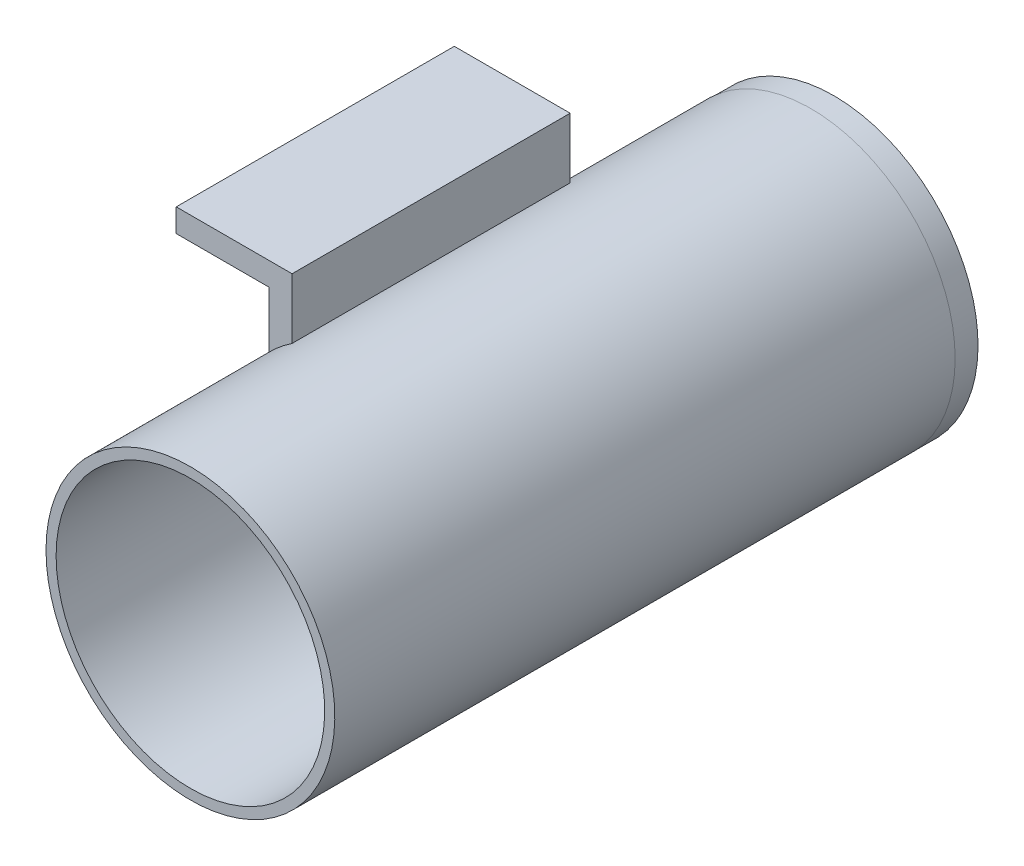
ISO-10303-21;
HEADER;
FILE_DESCRIPTION(('STEP AP214'),'2;1');
FILE_NAME('part.step','',(''),(''),'','','');
FILE_SCHEMA(('AUTOMOTIVE_DESIGN { 1 0 10303 214 1 1 1 1 }'));
ENDSEC;
DATA;
#1=APPLICATION_CONTEXT('core data for automotive mechanical design processes');
#2=APPLICATION_PROTOCOL_DEFINITION('international standard','automotive_design',2000,#1);
#3=PRODUCT_CONTEXT('',#1,'mechanical');
#4=PRODUCT('Part','Part','',(#3));
#5=PRODUCT_RELATED_PRODUCT_CATEGORY('part','',(#4));
#6=PRODUCT_DEFINITION_FORMATION('','',#4);
#7=PRODUCT_DEFINITION_CONTEXT('part definition',#1,'design');
#8=PRODUCT_DEFINITION('design','',#6,#7);
#9=PRODUCT_DEFINITION_SHAPE('','',#8);
#10=(LENGTH_UNIT() NAMED_UNIT(*) SI_UNIT(.MILLI.,.METRE.));
#11=(NAMED_UNIT(*) PLANE_ANGLE_UNIT() SI_UNIT($,.RADIAN.));
#12=(NAMED_UNIT(*) SI_UNIT($,.STERADIAN.) SOLID_ANGLE_UNIT());
#13=UNCERTAINTY_MEASURE_WITH_UNIT(LENGTH_MEASURE(1.E-05),#10,'distance_accuracy_value','');
#14=(GEOMETRIC_REPRESENTATION_CONTEXT(3) GLOBAL_UNCERTAINTY_ASSIGNED_CONTEXT((#13)) GLOBAL_UNIT_ASSIGNED_CONTEXT((#10,
#11,#12)) REPRESENTATION_CONTEXT('',''));
#15=CARTESIAN_POINT('',(0.,0.,0.));
#16=DIRECTION('',(0.,0.,1.));
#17=DIRECTION('',(1.,0.,0.));
#18=AXIS2_PLACEMENT_3D('',#15,#16,#17);
#19=CARTESIAN_POINT('',(-9.81200661546478,0.,38.1));
#20=DIRECTION('',(1.,0.,0.));
#21=DIRECTION('',(0.,1.,0.));
#22=AXIS2_PLACEMENT_3D('',#19,#20,#21);
#23=PLANE('',#22);
#24=DIRECTION('',(0.,0.,1.));
#25=VECTOR('',#24,1.);
#26=CARTESIAN_POINT('',(-9.81200661546478,0.974223450392017,-22.));
#27=LINE('',#26,#25);
#28=CARTESIAN_POINT('',(-9.81200661546478,0.974223450392015,38.1));
#29=VERTEX_POINT('',#28);
#30=CARTESIAN_POINT('',(-9.81200661546478,0.974223450392015,0.));
#31=VERTEX_POINT('',#30);
#32=EDGE_CURVE('E207',#29,#31,#27,.F.);
#33=ORIENTED_EDGE('',*,*,#32,.F.);
#34=DIRECTION('',(0.,-1.,0.));
#35=VECTOR('',#34,1.);
#36=CARTESIAN_POINT('',(-9.81200661546478,0.,38.1));
#37=LINE('',#36,#35);
#38=CARTESIAN_POINT('',(-9.81200661546479,8.7007021203464,38.1));
#39=VERTEX_POINT('',#38);
#40=EDGE_CURVE('E220',#39,#29,#37,.T.);
#41=ORIENTED_EDGE('',*,*,#40,.F.);
#42=DIRECTION('',(0.,0.,-1.));
#43=VECTOR('',#42,1.);
#44=CARTESIAN_POINT('',(-9.81200661546479,8.7007021203464,38.1));
#45=LINE('',#44,#43);
#46=CARTESIAN_POINT('',(-9.81200661546479,8.7007021203464,0.));
#47=VERTEX_POINT('',#46);
#48=EDGE_CURVE('E254',#39,#47,#45,.T.);
#49=ORIENTED_EDGE('',*,*,#48,.T.);
#50=DIRECTION('',(0.,-1.,0.));
#51=VECTOR('',#50,1.);
#52=CARTESIAN_POINT('',(-9.81200661546478,0.,0.));
#53=LINE('',#52,#51);
#54=EDGE_CURVE('E238',#47,#31,#53,.T.);
#55=ORIENTED_EDGE('',*,*,#54,.T.);
#56=EDGE_LOOP('',(#33,#41,#49,#55));
#57=FACE_BOUND('',#56,.T.);
#58=ADVANCED_FACE('F34',(#57),#23,.F.);
#59=CARTESIAN_POINT('',(-6.63700661546478,0.,38.1));
#60=DIRECTION('',(1.,0.,0.));
#61=DIRECTION('',(0.,1.,0.));
#62=AXIS2_PLACEMENT_3D('',#59,#60,#61);
#63=PLANE('',#62);
#64=DIRECTION('',(0.,-1.,0.));
#65=VECTOR('',#64,1.);
#66=CARTESIAN_POINT('',(-6.63700661546478,0.,38.1));
#67=LINE('',#66,#65);
#68=CARTESIAN_POINT('',(-6.63700661546479,11.8757021203464,38.1));
#69=VERTEX_POINT('',#68);
#70=CARTESIAN_POINT('',(-6.63700661546478,3.60496778517396,38.1));
#71=VERTEX_POINT('',#70);
#72=EDGE_CURVE('E227',#69,#71,#67,.T.);
#73=ORIENTED_EDGE('',*,*,#72,.T.);
#74=DIRECTION('',(0.,0.,1.));
#75=VECTOR('',#74,1.);
#76=CARTESIAN_POINT('',(-6.63700661546478,3.60496778517396,-22.));
#77=LINE('',#76,#75);
#78=CARTESIAN_POINT('',(-6.63700661546478,3.60496778517396,0.));
#79=VERTEX_POINT('',#78);
#80=EDGE_CURVE('E204',#71,#79,#77,.F.);
#81=ORIENTED_EDGE('',*,*,#80,.T.);
#82=DIRECTION('',(0.,-1.,0.));
#83=VECTOR('',#82,1.);
#84=CARTESIAN_POINT('',(-6.63700661546478,0.,0.));
#85=LINE('',#84,#83);
#86=CARTESIAN_POINT('',(-6.63700661546479,11.8757021203464,0.));
#87=VERTEX_POINT('',#86);
#88=EDGE_CURVE('E244',#87,#79,#85,.T.);
#89=ORIENTED_EDGE('',*,*,#88,.F.);
#90=DIRECTION('',(0.,0.,-1.));
#91=VECTOR('',#90,1.);
#92=CARTESIAN_POINT('',(-6.63700661546479,11.8757021203464,38.1));
#93=LINE('',#92,#91);
#94=EDGE_CURVE('E249',#69,#87,#93,.T.);
#95=ORIENTED_EDGE('',*,*,#94,.F.);
#96=EDGE_LOOP('',(#73,#81,#89,#95));
#97=FACE_BOUND('',#96,.T.);
#98=ADVANCED_FACE('F285',(#97),#63,.T.);
#99=CARTESIAN_POINT('',(-22.5120066154648,0.,38.1));
#100=DIRECTION('',(-1.,0.,0.));
#101=DIRECTION('',(0.,0.,1.));
#102=AXIS2_PLACEMENT_3D('',#99,#100,#101);
#103=PLANE('',#102);
#104=DIRECTION('',(0.,1.,0.));
#105=VECTOR('',#104,1.);
#106=CARTESIAN_POINT('',(-22.5120066154648,0.,0.));
#107=LINE('',#106,#105);
#108=CARTESIAN_POINT('',(-22.5120066154648,8.7007021203464,0.));
#109=VERTEX_POINT('',#108);
#110=CARTESIAN_POINT('',(-22.5120066154648,11.8757021203464,0.));
#111=VERTEX_POINT('',#110);
#112=EDGE_CURVE('E212',#109,#111,#107,.T.);
#113=ORIENTED_EDGE('',*,*,#112,.F.);
#114=DIRECTION('',(0.,0.,-1.));
#115=VECTOR('',#114,1.);
#116=CARTESIAN_POINT('',(-22.5120066154648,8.7007021203464,38.1));
#117=LINE('',#116,#115);
#118=CARTESIAN_POINT('',(-22.5120066154648,8.7007021203464,38.1));
#119=VERTEX_POINT('',#118);
#120=EDGE_CURVE('E256',#119,#109,#117,.T.);
#121=ORIENTED_EDGE('',*,*,#120,.F.);
#122=DIRECTION('',(0.,1.,0.));
#123=VECTOR('',#122,1.);
#124=CARTESIAN_POINT('',(-22.5120066154648,0.,38.1));
#125=LINE('',#124,#123);
#126=CARTESIAN_POINT('',(-22.5120066154648,11.8757021203464,38.1));
#127=VERTEX_POINT('',#126);
#128=EDGE_CURVE('E213',#119,#127,#125,.T.);
#129=ORIENTED_EDGE('',*,*,#128,.T.);
#130=DIRECTION('',(0.,0.,-1.));
#131=VECTOR('',#130,1.);
#132=CARTESIAN_POINT('',(-22.5120066154648,11.8757021203464,38.1));
#133=LINE('',#132,#131);
#134=EDGE_CURVE('E232',#127,#111,#133,.T.);
#135=ORIENTED_EDGE('',*,*,#134,.T.);
#136=EDGE_LOOP('',(#113,#121,#129,#135));
#137=FACE_BOUND('',#136,.T.);
#138=ADVANCED_FACE('F36',(#137),#103,.T.);
#139=CARTESIAN_POINT('',(0.,8.7007021203464,38.1));
#140=DIRECTION('',(0.,-1.,0.));
#141=DIRECTION('',(0.,0.,-1.));
#142=AXIS2_PLACEMENT_3D('',#139,#140,#141);
#143=PLANE('',#142);
#144=DIRECTION('',(-1.,0.,0.));
#145=VECTOR('',#144,1.);
#146=CARTESIAN_POINT('',(0.,8.7007021203464,0.));
#147=LINE('',#146,#145);
#148=EDGE_CURVE('E235',#47,#109,#147,.T.);
#149=ORIENTED_EDGE('',*,*,#148,.F.);
#150=ORIENTED_EDGE('',*,*,#48,.F.);
#151=DIRECTION('',(-1.,0.,0.));
#152=VECTOR('',#151,1.);
#153=CARTESIAN_POINT('',(0.,8.7007021203464,38.1));
#154=LINE('',#153,#152);
#155=EDGE_CURVE('E216',#39,#119,#154,.T.);
#156=ORIENTED_EDGE('',*,*,#155,.T.);
#157=ORIENTED_EDGE('',*,*,#120,.T.);
#158=EDGE_LOOP('',(#149,#150,#156,#157));
#159=FACE_BOUND('',#158,.T.);
#160=ADVANCED_FACE('F301',(#159),#143,.T.);
#161=CARTESIAN_POINT('',(0.,11.8757021203464,38.1));
#162=DIRECTION('',(0.,-1.,0.));
#163=DIRECTION('',(1.,0.,0.));
#164=AXIS2_PLACEMENT_3D('',#161,#162,#163);
#165=PLANE('',#164);
#166=DIRECTION('',(-1.,0.,0.));
#167=VECTOR('',#166,1.);
#168=CARTESIAN_POINT('',(0.,11.8757021203464,0.));
#169=LINE('',#168,#167);
#170=EDGE_CURVE('E217',#87,#111,#169,.T.);
#171=ORIENTED_EDGE('',*,*,#170,.T.);
#172=ORIENTED_EDGE('',*,*,#134,.F.);
#173=DIRECTION('',(-1.,0.,0.));
#174=VECTOR('',#173,1.);
#175=CARTESIAN_POINT('',(0.,11.8757021203464,38.1));
#176=LINE('',#175,#174);
#177=EDGE_CURVE('E230',#69,#127,#176,.T.);
#178=ORIENTED_EDGE('',*,*,#177,.F.);
#179=ORIENTED_EDGE('',*,*,#94,.T.);
#180=EDGE_LOOP('',(#171,#172,#178,#179));
#181=FACE_BOUND('',#180,.T.);
#182=ADVANCED_FACE('F291',(#181),#165,.F.);
#183=CARTESIAN_POINT('',(0.,0.,38.1));
#184=DIRECTION('',(0.,0.,1.));
#185=DIRECTION('',(1.,0.,0.));
#186=AXIS2_PLACEMENT_3D('',#183,#184,#185);
#187=PLANE('',#186);
#188=ORIENTED_EDGE('',*,*,#40,.T.);
#189=CARTESIAN_POINT('',(4.32977813053361,-12.8619542844802,38.1));
#190=DIRECTION('',(0.,0.,1.));
#191=DIRECTION('',(1.,0.,0.));
#192=AXIS2_PLACEMENT_3D('',#189,#190,#191);
#193=CIRCLE('',#192,19.7845871858153);
#194=EDGE_CURVE('E210',#29,#71,#193,.F.);
#195=ORIENTED_EDGE('',*,*,#194,.T.);
#196=ORIENTED_EDGE('',*,*,#72,.F.);
#197=ORIENTED_EDGE('',*,*,#177,.T.);
#198=ORIENTED_EDGE('',*,*,#128,.F.);
#199=ORIENTED_EDGE('',*,*,#155,.F.);
#200=EDGE_LOOP('',(#188,#195,#196,#197,#198,#199));
#201=FACE_BOUND('',#200,.T.);
#202=ADVANCED_FACE('F279',(#201),#187,.T.);
#203=CARTESIAN_POINT('',(0.,0.,0.));
#204=DIRECTION('',(0.,0.,1.));
#205=DIRECTION('',(1.,0.,0.));
#206=AXIS2_PLACEMENT_3D('',#203,#204,#205);
#207=PLANE('',#206);
#208=CARTESIAN_POINT('',(4.32977813053361,-12.8619542844802,0.));
#209=DIRECTION('',(0.,0.,1.));
#210=DIRECTION('',(1.,0.,0.));
#211=AXIS2_PLACEMENT_3D('',#208,#209,#210);
#212=CIRCLE('',#211,19.7845871858153);
#213=EDGE_CURVE('E11',#31,#79,#212,.F.);
#214=ORIENTED_EDGE('',*,*,#213,.F.);
#215=ORIENTED_EDGE('',*,*,#54,.F.);
#216=ORIENTED_EDGE('',*,*,#148,.T.);
#217=ORIENTED_EDGE('',*,*,#112,.T.);
#218=ORIENTED_EDGE('',*,*,#170,.F.);
#219=ORIENTED_EDGE('',*,*,#88,.T.);
#220=EDGE_LOOP('',(#214,#215,#216,#217,#218,#219));
#221=FACE_BOUND('',#220,.T.);
#222=ADVANCED_FACE('F288',(#221),#207,.F.);
#223=CARTESIAN_POINT('',(4.32977813053361,-12.8619542844802,-22.));
#224=DIRECTION('',(0.,0.,-1.));
#225=DIRECTION('',(-1.,0.,0.));
#226=AXIS2_PLACEMENT_3D('',#223,#224,#225);
#227=PLANE('',#226);
#228=CARTESIAN_POINT('',(4.32977813053361,-12.8619542844802,-22.));
#229=DIRECTION('',(0.,0.,-1.));
#230=DIRECTION('',(-1.,0.,0.));
#231=AXIS2_PLACEMENT_3D('',#228,#229,#230);
#232=CIRCLE('',#231,19.7845871858153);
#233=CARTESIAN_POINT('',(1.9897508336412,-32.507670417086,-22.));
#234=VERTEX_POINT('',#233);
#235=EDGE_CURVE('E193',#234,#234,#232,.T.);
#236=ORIENTED_EDGE('',*,*,#235,.T.);
#237=CARTESIAN_POINT('',(4.3255656269204,-12.897320389099,-22.));
#238=DIRECTION('',(0.,0.,-1.));
#239=DIRECTION('',(-1.,0.,0.));
#240=AXIS2_PLACEMENT_3D('',#237,#238,#239);
#241=CIRCLE('',#240,19.7489710863294);
#242=EDGE_CURVE('E177',#234,#234,#241,.T.);
#243=ORIENTED_EDGE('',*,*,#242,.F.);
#244=EDGE_LOOP('',(#236,#243));
#245=FACE_BOUND('',#244,.T.);
#246=ADVANCED_FACE('F329',(#245),#227,.T.);
#247=CARTESIAN_POINT('',(4.32977813053361,-12.8619542844802,-22.));
#248=DIRECTION('',(0.,0.,1.));
#249=DIRECTION('',(1.,0.,0.));
#250=AXIS2_PLACEMENT_3D('',#247,#248,#249);
#251=CYLINDRICAL_SURFACE('',#250,19.7845871858153);
#252=ORIENTED_EDGE('',*,*,#194,.F.);
#253=ORIENTED_EDGE('',*,*,#32,.T.);
#254=ORIENTED_EDGE('',*,*,#213,.T.);
#255=ORIENTED_EDGE('',*,*,#80,.F.);
#256=EDGE_LOOP('',(#252,#253,#254,#255));
#257=FACE_BOUND('',#256,.T.);
#258=ORIENTED_EDGE('',*,*,#235,.F.);
#259=EDGE_LOOP('',(#258));
#260=FACE_BOUND('',#259,.T.);
#261=CARTESIAN_POINT('',(4.32977813053361,-12.8619542844802,63.));
#262=DIRECTION('',(0.,0.,-1.));
#263=DIRECTION('',(-1.,0.,0.));
#264=AXIS2_PLACEMENT_3D('',#261,#262,#263);
#265=CIRCLE('',#264,19.7845871858153);
#266=CARTESIAN_POINT('',(-15.4548090552817,-12.8619542844802,63.));
#267=VERTEX_POINT('',#266);
#268=EDGE_CURVE('E190',#267,#267,#265,.T.);
#269=ORIENTED_EDGE('',*,*,#268,.T.);
#270=EDGE_LOOP('',(#269));
#271=FACE_BOUND('',#270,.T.);
#272=ADVANCED_FACE('F319',(#257,#260,#271),#251,.T.);
#273=CARTESIAN_POINT('',(4.32977813053361,-12.8619542844802,-22.));
#274=DIRECTION('',(0.,0.,1.));
#275=DIRECTION('',(1.,0.,0.));
#276=AXIS2_PLACEMENT_3D('',#273,#274,#275);
#277=CYLINDRICAL_SURFACE('',#276,18.3999999999997);
#278=DIRECTION('',(0.,0.,1.));
#279=VECTOR('',#278,1.);
#280=CARTESIAN_POINT('',(-7.91100601521927,0.875702120346397,-22.));
#281=LINE('',#280,#279);
#282=CARTESIAN_POINT('',(-7.91100601521927,0.875702120346397,38.1));
#283=VERTEX_POINT('',#282);
#284=CARTESIAN_POINT('',(-7.91100601521927,0.8757021203464,0.));
#285=VERTEX_POINT('',#284);
#286=EDGE_CURVE('E199',#283,#285,#281,.F.);
#287=ORIENTED_EDGE('',*,*,#286,.F.);
#288=CARTESIAN_POINT('',(4.32977813053361,-12.8619542844802,38.1));
#289=DIRECTION('',(0.,0.,1.));
#290=DIRECTION('',(1.,0.,0.));
#291=AXIS2_PLACEMENT_3D('',#288,#289,#290);
#292=CIRCLE('',#291,18.3999999999997);
#293=CARTESIAN_POINT('',(-6.63700661546478,1.91267370863439,38.1));
#294=VERTEX_POINT('',#293);
#295=EDGE_CURVE('E202',#283,#294,#292,.F.);
#296=ORIENTED_EDGE('',*,*,#295,.T.);
#297=DIRECTION('',(0.,0.,1.));
#298=VECTOR('',#297,1.);
#299=CARTESIAN_POINT('',(-6.63700661546478,1.91267370863439,-22.));
#300=LINE('',#299,#298);
#301=CARTESIAN_POINT('',(-6.63700661546478,1.91267370863439,0.));
#302=VERTEX_POINT('',#301);
#303=EDGE_CURVE('E197',#294,#302,#300,.F.);
#304=ORIENTED_EDGE('',*,*,#303,.T.);
#305=CARTESIAN_POINT('',(4.32977813053361,-12.8619542844802,0.));
#306=DIRECTION('',(0.,0.,1.));
#307=DIRECTION('',(1.,0.,0.));
#308=AXIS2_PLACEMENT_3D('',#305,#306,#307);
#309=CIRCLE('',#308,18.3999999999997);
#310=EDGE_CURVE('E42',#285,#302,#309,.F.);
#311=ORIENTED_EDGE('',*,*,#310,.F.);
#312=EDGE_LOOP('',(#287,#296,#304,#311));
#313=FACE_BOUND('',#312,.T.);
#314=CARTESIAN_POINT('',(4.32977813053361,-12.8619542844802,-22.));
#315=DIRECTION('',(0.,0.,-1.));
#316=DIRECTION('',(-1.,0.,0.));
#317=AXIS2_PLACEMENT_3D('',#314,#315,#316);
#318=CIRCLE('',#317,18.3999999999997);
#319=CARTESIAN_POINT('',(12.7789529267375,-29.2073342208164,-22.));
#320=VERTEX_POINT('',#319);
#321=CARTESIAN_POINT('',(11.4074617032265,-29.8462527758758,-22.));
#322=VERTEX_POINT('',#321);
#323=EDGE_CURVE('E145',#320,#322,#318,.T.);
#324=ORIENTED_EDGE('',*,*,#323,.T.);
#325=EDGE_CURVE('E184',#322,#320,#318,.T.);
#326=ORIENTED_EDGE('',*,*,#325,.T.);
#327=EDGE_LOOP('',(#324,#326));
#328=FACE_BOUND('',#327,.T.);
#329=CARTESIAN_POINT('',(4.32977813053361,-12.8619542844802,63.));
#330=DIRECTION('',(0.,0.,-1.));
#331=DIRECTION('',(-1.,0.,0.));
#332=AXIS2_PLACEMENT_3D('',#329,#330,#331);
#333=CIRCLE('',#332,18.3999999999997);
#334=CARTESIAN_POINT('',(-14.0702218694661,-12.8619542844802,63.));
#335=VERTEX_POINT('',#334);
#336=EDGE_CURVE('E187',#335,#335,#333,.T.);
#337=ORIENTED_EDGE('',*,*,#336,.F.);
#338=EDGE_LOOP('',(#337));
#339=FACE_BOUND('',#338,.T.);
#340=ADVANCED_FACE('F273',(#313,#328,#339),#277,.F.);
#341=CARTESIAN_POINT('',(4.32977813053361,-12.8619542844802,63.));
#342=DIRECTION('',(0.,0.,-1.));
#343=DIRECTION('',(-1.,0.,0.));
#344=AXIS2_PLACEMENT_3D('',#341,#342,#343);
#345=PLANE('',#344);
#346=ORIENTED_EDGE('',*,*,#336,.T.);
#347=EDGE_LOOP('',(#346));
#348=FACE_BOUND('',#347,.T.);
#349=ORIENTED_EDGE('',*,*,#268,.F.);
#350=EDGE_LOOP('',(#349));
#351=FACE_BOUND('',#350,.T.);
#352=ADVANCED_FACE('F286',(#348,#351),#345,.F.);
#353=DIRECTION('',(1.,0.,0.));
#354=VECTOR('',#353,1.);
#355=CARTESIAN_POINT('',(0.,0.8757021203464,0.));
#356=LINE('',#355,#354);
#357=CARTESIAN_POINT('',(-6.63700661546478,0.8757021203464,0.));
#358=VERTEX_POINT('',#357);
#359=EDGE_CURVE('E241',#285,#358,#356,.T.);
#360=ORIENTED_EDGE('',*,*,#359,.F.);
#361=ORIENTED_EDGE('',*,*,#310,.T.);
#362=EDGE_CURVE('E243',#302,#358,#85,.T.);
#363=ORIENTED_EDGE('',*,*,#362,.T.);
#364=EDGE_LOOP('',(#360,#361,#363));
#365=FACE_BOUND('',#364,.T.);
#366=ADVANCED_FACE('F262',(#365),#207,.F.);
#367=ORIENTED_EDGE('',*,*,#295,.F.);
#368=DIRECTION('',(1.,0.,0.));
#369=VECTOR('',#368,1.);
#370=CARTESIAN_POINT('',(0.,0.8757021203464,38.1));
#371=LINE('',#370,#369);
#372=CARTESIAN_POINT('',(-6.63700661546478,0.8757021203464,38.1));
#373=VERTEX_POINT('',#372);
#374=EDGE_CURVE('E223',#283,#373,#371,.T.);
#375=ORIENTED_EDGE('',*,*,#374,.T.);
#376=EDGE_CURVE('E226',#294,#373,#67,.T.);
#377=ORIENTED_EDGE('',*,*,#376,.F.);
#378=EDGE_LOOP('',(#367,#375,#377));
#379=FACE_BOUND('',#378,.T.);
#380=ADVANCED_FACE('F276',(#379),#187,.T.);
#381=ORIENTED_EDGE('',*,*,#303,.F.);
#382=ORIENTED_EDGE('',*,*,#376,.T.);
#383=DIRECTION('',(0.,0.,-1.));
#384=VECTOR('',#383,1.);
#385=CARTESIAN_POINT('',(-6.63700661546478,0.8757021203464,38.1));
#386=LINE('',#385,#384);
#387=EDGE_CURVE('E251',#373,#358,#386,.T.);
#388=ORIENTED_EDGE('',*,*,#387,.T.);
#389=ORIENTED_EDGE('',*,*,#362,.F.);
#390=EDGE_LOOP('',(#381,#382,#388,#389));
#391=FACE_BOUND('',#390,.T.);
#392=ADVANCED_FACE('F266',(#391),#63,.T.);
#393=CARTESIAN_POINT('',(0.,0.8757021203464,38.1));
#394=DIRECTION('',(0.,1.,0.));
#395=DIRECTION('',(0.,0.,1.));
#396=AXIS2_PLACEMENT_3D('',#393,#394,#395);
#397=PLANE('',#396);
#398=ORIENTED_EDGE('',*,*,#374,.F.);
#399=ORIENTED_EDGE('',*,*,#286,.T.);
#400=ORIENTED_EDGE('',*,*,#359,.T.);
#401=ORIENTED_EDGE('',*,*,#387,.F.);
#402=EDGE_LOOP('',(#398,#399,#400,#401));
#403=FACE_BOUND('',#402,.T.);
#404=ADVANCED_FACE('F271',(#403),#397,.F.);
#405=CARTESIAN_POINT('',(4.3255656269204,-12.897320389099,-25.175));
#406=DIRECTION('',(0.,0.,-1.));
#407=DIRECTION('',(-1.,0.,0.));
#408=AXIS2_PLACEMENT_3D('',#405,#406,#407);
#409=PLANE('',#408);
#410=DIRECTION('',(0.,-1.,0.));
#411=VECTOR('',#410,1.);
#412=CARTESIAN_POINT('',(12.7789529267375,-19.0774006118701,-25.175));
#413=LINE('',#412,#411);
#414=CARTESIAN_POINT('',(12.7789529267375,-19.0774006118701,-25.175));
#415=VERTEX_POINT('',#414);
#416=CARTESIAN_POINT('',(12.7789529267375,-29.8462527758758,-25.175));
#417=VERTEX_POINT('',#416);
#418=EDGE_CURVE('E57',#415,#417,#413,.T.);
#419=ORIENTED_EDGE('',*,*,#418,.F.);
#420=DIRECTION('',(1.,0.,0.));
#421=VECTOR('',#420,1.);
#422=CARTESIAN_POINT('',(12.7789529267375,-19.0774006118701,-25.175));
#423=LINE('',#422,#421);
#424=CARTESIAN_POINT('',(10.2548901459301,-19.0774006118701,-25.175));
#425=VERTEX_POINT('',#424);
#426=EDGE_CURVE('E149',#425,#415,#423,.T.);
#427=ORIENTED_EDGE('',*,*,#426,.F.);
#428=DIRECTION('',(0.,1.,0.));
#429=VECTOR('',#428,1.);
#430=CARTESIAN_POINT('',(10.2548901459301,-19.0774006118701,-25.175));
#431=LINE('',#430,#429);
#432=CARTESIAN_POINT('',(10.2548901459301,-29.8462527758758,-25.175));
#433=VERTEX_POINT('',#432);
#434=EDGE_CURVE('E170',#433,#425,#431,.T.);
#435=ORIENTED_EDGE('',*,*,#434,.F.);
#436=DIRECTION('',(-1.,0.,0.));
#437=VECTOR('',#436,1.);
#438=CARTESIAN_POINT('',(12.7789529267375,-29.8462527758758,-25.175));
#439=LINE('',#438,#437);
#440=EDGE_CURVE('E168',#417,#433,#439,.T.);
#441=ORIENTED_EDGE('',*,*,#440,.F.);
#442=EDGE_LOOP('',(#419,#427,#435,#441));
#443=FACE_BOUND('',#442,.T.);
#444=CARTESIAN_POINT('',(4.3255656269204,-12.897320389099,-25.175));
#445=DIRECTION('',(0.,0.,-1.));
#446=DIRECTION('',(-1.,0.,0.));
#447=AXIS2_PLACEMENT_3D('',#444,#445,#446);
#448=CIRCLE('',#447,19.7489710863294);
#449=CARTESIAN_POINT('',(-15.4234054594089,-12.897320389099,-25.175));
#450=VERTEX_POINT('',#449);
#451=EDGE_CURVE('E181',#450,#450,#448,.T.);
#452=ORIENTED_EDGE('',*,*,#451,.T.);
#453=EDGE_LOOP('',(#452));
#454=FACE_BOUND('',#453,.T.);
#455=ADVANCED_FACE('F353',(#443,#454),#409,.T.);
#456=CARTESIAN_POINT('',(4.3255656269204,-12.897320389099,-25.175));
#457=DIRECTION('',(0.,0.,1.));
#458=DIRECTION('',(1.,0.,0.));
#459=AXIS2_PLACEMENT_3D('',#456,#457,#458);
#460=CYLINDRICAL_SURFACE('',#459,19.7489710863294);
#461=ORIENTED_EDGE('',*,*,#451,.F.);
#462=EDGE_LOOP('',(#461));
#463=FACE_BOUND('',#462,.T.);
#464=ORIENTED_EDGE('',*,*,#242,.T.);
#465=EDGE_LOOP('',(#464));
#466=FACE_BOUND('',#465,.T.);
#467=ADVANCED_FACE('F341',(#463,#466),#460,.T.);
#468=CARTESIAN_POINT('',(4.3255656269204,-12.897320389099,-22.));
#469=DIRECTION('',(0.,0.,-1.));
#470=DIRECTION('',(-1.,0.,0.));
#471=AXIS2_PLACEMENT_3D('',#468,#469,#470);
#472=PLANE('',#471);
#473=DIRECTION('',(1.,0.,0.));
#474=VECTOR('',#473,1.);
#475=CARTESIAN_POINT('',(12.7789529267375,-19.0774006118701,-22.));
#476=LINE('',#475,#474);
#477=CARTESIAN_POINT('',(10.2548901459301,-19.0774006118701,-22.));
#478=VERTEX_POINT('',#477);
#479=CARTESIAN_POINT('',(12.7789529267375,-19.0774006118701,-22.));
#480=VERTEX_POINT('',#479);
#481=EDGE_CURVE('E157',#478,#480,#476,.T.);
#482=ORIENTED_EDGE('',*,*,#481,.T.);
#483=DIRECTION('',(0.,-1.,0.));
#484=VECTOR('',#483,1.);
#485=CARTESIAN_POINT('',(12.7789529267375,-19.0774006118701,-22.));
#486=LINE('',#485,#484);
#487=EDGE_CURVE('E148',#480,#320,#486,.T.);
#488=ORIENTED_EDGE('',*,*,#487,.T.);
#489=ORIENTED_EDGE('',*,*,#325,.F.);
#490=DIRECTION('',(-1.,0.,0.));
#491=VECTOR('',#490,1.);
#492=CARTESIAN_POINT('',(12.7789529267375,-29.8462527758758,-22.));
#493=LINE('',#492,#491);
#494=CARTESIAN_POINT('',(10.2548901459301,-29.8462527758758,-22.));
#495=VERTEX_POINT('',#494);
#496=EDGE_CURVE('E161',#322,#495,#493,.T.);
#497=ORIENTED_EDGE('',*,*,#496,.T.);
#498=DIRECTION('',(0.,1.,0.));
#499=VECTOR('',#498,1.);
#500=CARTESIAN_POINT('',(10.2548901459301,-19.0774006118701,-22.));
#501=LINE('',#500,#499);
#502=EDGE_CURVE('E49',#495,#478,#501,.T.);
#503=ORIENTED_EDGE('',*,*,#502,.T.);
#504=EDGE_LOOP('',(#482,#488,#489,#497,#503));
#505=FACE_BOUND('',#504,.T.);
#506=ADVANCED_FACE('F352',(#505),#472,.F.);
#507=CARTESIAN_POINT('',(12.7789529267375,-19.0774006118701,-22.));
#508=DIRECTION('',(1.,0.,0.));
#509=DIRECTION('',(0.,0.,-1.));
#510=AXIS2_PLACEMENT_3D('',#507,#508,#509);
#511=PLANE('',#510);
#512=ORIENTED_EDGE('',*,*,#418,.T.);
#513=DIRECTION('',(0.,0.,-1.));
#514=VECTOR('',#513,1.);
#515=CARTESIAN_POINT('',(12.7789529267375,-29.8462527758758,-22.));
#516=LINE('',#515,#514);
#517=CARTESIAN_POINT('',(12.7789529267375,-29.8462527758758,-22.));
#518=VERTEX_POINT('',#517);
#519=EDGE_CURVE('E151',#518,#417,#516,.T.);
#520=ORIENTED_EDGE('',*,*,#519,.F.);
#521=EDGE_CURVE('E139',#320,#518,#486,.T.);
#522=ORIENTED_EDGE('',*,*,#521,.F.);
#523=ORIENTED_EDGE('',*,*,#487,.F.);
#524=DIRECTION('',(0.,0.,-1.));
#525=VECTOR('',#524,1.);
#526=CARTESIAN_POINT('',(12.7789529267375,-19.0774006118701,-22.));
#527=LINE('',#526,#525);
#528=EDGE_CURVE('E175',#480,#415,#527,.T.);
#529=ORIENTED_EDGE('',*,*,#528,.T.);
#530=EDGE_LOOP('',(#512,#520,#522,#523,#529));
#531=FACE_BOUND('',#530,.T.);
#532=ADVANCED_FACE('F152',(#531),#511,.F.);
#533=CARTESIAN_POINT('',(12.7789529267375,-19.0774006118701,-22.));
#534=DIRECTION('',(0.,1.,0.));
#535=DIRECTION('',(0.,0.,1.));
#536=AXIS2_PLACEMENT_3D('',#533,#534,#535);
#537=PLANE('',#536);
#538=ORIENTED_EDGE('',*,*,#426,.T.);
#539=ORIENTED_EDGE('',*,*,#528,.F.);
#540=ORIENTED_EDGE('',*,*,#481,.F.);
#541=DIRECTION('',(0.,0.,-1.));
#542=VECTOR('',#541,1.);
#543=CARTESIAN_POINT('',(10.2548901459301,-19.0774006118701,-22.));
#544=LINE('',#543,#542);
#545=EDGE_CURVE('E178',#478,#425,#544,.T.);
#546=ORIENTED_EDGE('',*,*,#545,.T.);
#547=EDGE_LOOP('',(#538,#539,#540,#546));
#548=FACE_BOUND('',#547,.T.);
#549=ADVANCED_FACE('F370',(#548),#537,.F.);
#550=CARTESIAN_POINT('',(10.2548901459301,-19.0774006118701,-22.));
#551=DIRECTION('',(-1.,0.,0.));
#552=DIRECTION('',(0.,0.,1.));
#553=AXIS2_PLACEMENT_3D('',#550,#551,#552);
#554=PLANE('',#553);
#555=ORIENTED_EDGE('',*,*,#434,.T.);
#556=ORIENTED_EDGE('',*,*,#545,.F.);
#557=ORIENTED_EDGE('',*,*,#502,.F.);
#558=DIRECTION('',(0.,0.,-1.));
#559=VECTOR('',#558,1.);
#560=CARTESIAN_POINT('',(10.2548901459301,-29.8462527758758,-22.));
#561=LINE('',#560,#559);
#562=EDGE_CURVE('E156',#495,#433,#561,.T.);
#563=ORIENTED_EDGE('',*,*,#562,.T.);
#564=EDGE_LOOP('',(#555,#556,#557,#563));
#565=FACE_BOUND('',#564,.T.);
#566=ADVANCED_FACE('F373',(#565),#554,.F.);
#567=CARTESIAN_POINT('',(12.7789529267375,-29.8462527758758,-22.));
#568=DIRECTION('',(0.,-1.,0.));
#569=DIRECTION('',(0.,0.,-1.));
#570=AXIS2_PLACEMENT_3D('',#567,#568,#569);
#571=PLANE('',#570);
#572=ORIENTED_EDGE('',*,*,#440,.T.);
#573=ORIENTED_EDGE('',*,*,#562,.F.);
#574=ORIENTED_EDGE('',*,*,#496,.F.);
#575=EDGE_CURVE('E142',#518,#322,#493,.T.);
#576=ORIENTED_EDGE('',*,*,#575,.F.);
#577=ORIENTED_EDGE('',*,*,#519,.T.);
#578=EDGE_LOOP('',(#572,#573,#574,#576,#577));
#579=FACE_BOUND('',#578,.T.);
#580=ADVANCED_FACE('F159',(#579),#571,.F.);
#581=CARTESIAN_POINT('',(0.,0.,-22.));
#582=DIRECTION('',(0.,0.,-1.));
#583=DIRECTION('',(-1.,0.,0.));
#584=AXIS2_PLACEMENT_3D('',#581,#582,#583);
#585=PLANE('',#584);
#586=ORIENTED_EDGE('',*,*,#521,.T.);
#587=ORIENTED_EDGE('',*,*,#575,.T.);
#588=ORIENTED_EDGE('',*,*,#323,.F.);
#589=EDGE_LOOP('',(#586,#587,#588));
#590=FACE_BOUND('',#589,.T.);
#591=ADVANCED_FACE('F140',(#590),#585,.T.);
#592=CLOSED_SHELL('',(#58,#98,#138,#160,#182,#202,#222,#246,#272,#340,#352,#366,#380,#392,#404,
#455,#467,#506,#532,#549,#566,#580,#591));
#593=MANIFOLD_SOLID_BREP('B2',#592);
#594=ADVANCED_BREP_SHAPE_REPRESENTATION('',(#18,#593),#14);
#595=SHAPE_DEFINITION_REPRESENTATION(#9,#594);
ENDSEC;
END-ISO-10303-21;
